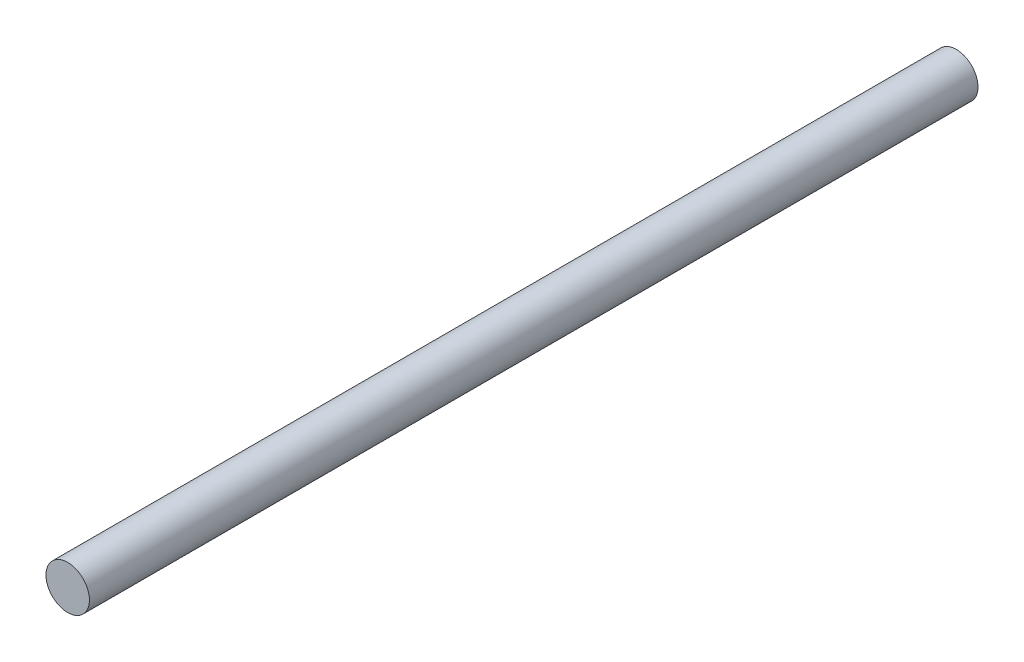
ISO-10303-21;
HEADER;
FILE_DESCRIPTION(('STEP AP214'),'2;1');
FILE_NAME('part.step','',(''),(''),'','','');
FILE_SCHEMA(('AUTOMOTIVE_DESIGN { 1 0 10303 214 1 1 1 1 }'));
ENDSEC;
DATA;
#1=APPLICATION_CONTEXT('core data for automotive mechanical design processes');
#2=APPLICATION_PROTOCOL_DEFINITION('international standard','automotive_design',2000,#1);
#3=PRODUCT_CONTEXT('',#1,'mechanical');
#4=PRODUCT('Part','Part','',(#3));
#5=PRODUCT_RELATED_PRODUCT_CATEGORY('part','',(#4));
#6=PRODUCT_DEFINITION_FORMATION('','',#4);
#7=PRODUCT_DEFINITION_CONTEXT('part definition',#1,'design');
#8=PRODUCT_DEFINITION('design','',#6,#7);
#9=PRODUCT_DEFINITION_SHAPE('','',#8);
#10=(LENGTH_UNIT() NAMED_UNIT(*) SI_UNIT(.MILLI.,.METRE.));
#11=(NAMED_UNIT(*) PLANE_ANGLE_UNIT() SI_UNIT($,.RADIAN.));
#12=(NAMED_UNIT(*) SI_UNIT($,.STERADIAN.) SOLID_ANGLE_UNIT());
#13=UNCERTAINTY_MEASURE_WITH_UNIT(LENGTH_MEASURE(1.E-05),#10,'distance_accuracy_value','');
#14=(GEOMETRIC_REPRESENTATION_CONTEXT(3) GLOBAL_UNCERTAINTY_ASSIGNED_CONTEXT((#13)) GLOBAL_UNIT_ASSIGNED_CONTEXT((#10,
#11,#12)) REPRESENTATION_CONTEXT('',''));
#15=CARTESIAN_POINT('',(0.,0.,0.));
#16=DIRECTION('',(0.,0.,1.));
#17=DIRECTION('',(1.,0.,0.));
#18=AXIS2_PLACEMENT_3D('',#15,#16,#17);
#19=CARTESIAN_POINT('',(0.,0.,163.5));
#20=DIRECTION('',(0.,0.,-1.));
#21=DIRECTION('',(-1.,0.,0.));
#22=AXIS2_PLACEMENT_3D('',#19,#20,#21);
#23=CYLINDRICAL_SURFACE('',#22,4.);
#24=CARTESIAN_POINT('',(0.,0.,163.5));
#25=DIRECTION('',(0.,0.,1.));
#26=DIRECTION('',(1.,0.,0.));
#27=AXIS2_PLACEMENT_3D('',#24,#25,#26);
#28=CIRCLE('',#27,4.);
#29=CARTESIAN_POINT('',(4.,0.,163.5));
#30=VERTEX_POINT('',#29);
#31=EDGE_CURVE('E10',#30,#30,#28,.T.);
#32=ORIENTED_EDGE('',*,*,#31,.F.);
#33=EDGE_LOOP('',(#32));
#34=FACE_BOUND('',#33,.T.);
#35=CARTESIAN_POINT('',(0.,0.,0.));
#36=DIRECTION('',(0.,0.,1.));
#37=DIRECTION('',(1.,0.,0.));
#38=AXIS2_PLACEMENT_3D('',#35,#36,#37);
#39=CIRCLE('',#38,4.);
#40=CARTESIAN_POINT('',(4.,0.,0.));
#41=VERTEX_POINT('',#40);
#42=EDGE_CURVE('E34',#41,#41,#39,.T.);
#43=ORIENTED_EDGE('',*,*,#42,.T.);
#44=EDGE_LOOP('',(#43));
#45=FACE_BOUND('',#44,.T.);
#46=ADVANCED_FACE('F31',(#34,#45),#23,.T.);
#47=CARTESIAN_POINT('',(0.,0.,163.5));
#48=DIRECTION('',(0.,0.,1.));
#49=DIRECTION('',(1.,0.,0.));
#50=AXIS2_PLACEMENT_3D('',#47,#48,#49);
#51=PLANE('',#50);
#52=ORIENTED_EDGE('',*,*,#31,.T.);
#53=EDGE_LOOP('',(#52));
#54=FACE_BOUND('',#53,.T.);
#55=ADVANCED_FACE('F46',(#54),#51,.T.);
#56=CARTESIAN_POINT('',(0.,0.,0.));
#57=DIRECTION('',(0.,0.,1.));
#58=DIRECTION('',(1.,0.,0.));
#59=AXIS2_PLACEMENT_3D('',#56,#57,#58);
#60=PLANE('',#59);
#61=ORIENTED_EDGE('',*,*,#42,.F.);
#62=EDGE_LOOP('',(#61));
#63=FACE_BOUND('',#62,.T.);
#64=ADVANCED_FACE('F44',(#63),#60,.F.);
#65=CLOSED_SHELL('',(#46,#55,#64));
#66=MANIFOLD_SOLID_BREP('B2',#65);
#67=ADVANCED_BREP_SHAPE_REPRESENTATION('',(#18,#66),#14);
#68=SHAPE_DEFINITION_REPRESENTATION(#9,#67);
ENDSEC;
END-ISO-10303-21;
